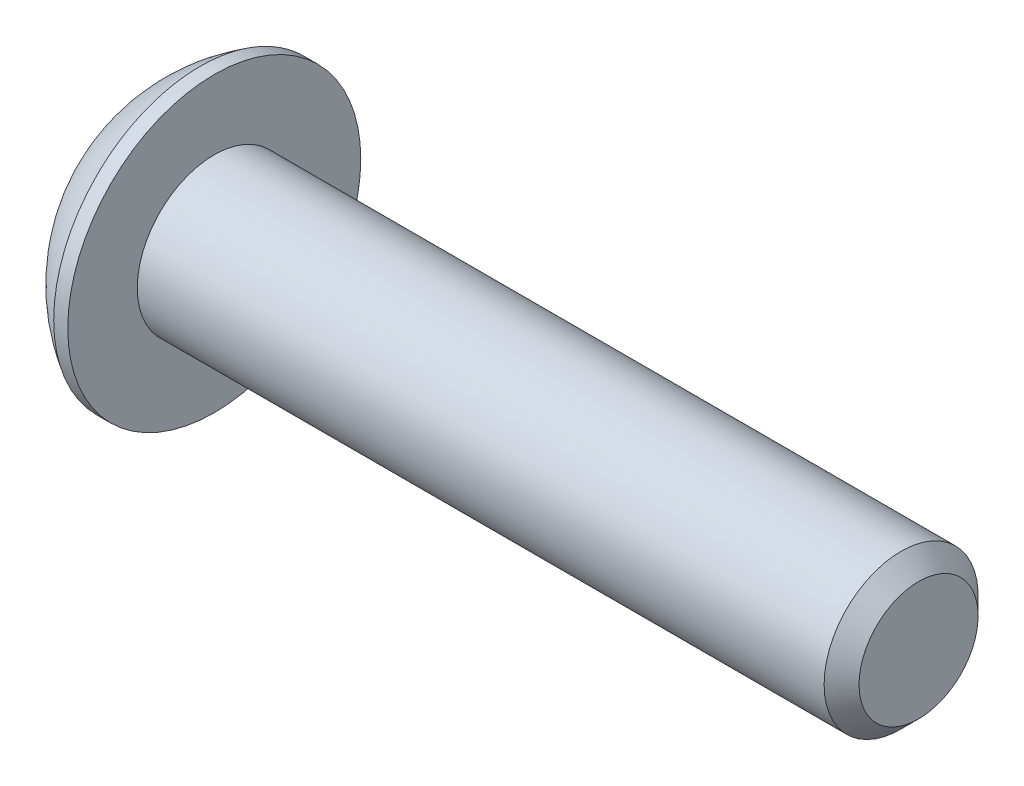
ISO-10303-21;
HEADER;
FILE_DESCRIPTION(('STEP AP214'),'2;1');
FILE_NAME('part.step','',(''),(''),'','','');
FILE_SCHEMA(('AUTOMOTIVE_DESIGN { 1 0 10303 214 1 1 1 1 }'));
ENDSEC;
DATA;
#1=APPLICATION_CONTEXT('core data for automotive mechanical design processes');
#2=APPLICATION_PROTOCOL_DEFINITION('international standard','automotive_design',2000,#1);
#3=PRODUCT_CONTEXT('',#1,'mechanical');
#4=PRODUCT('Part','Part','',(#3));
#5=PRODUCT_RELATED_PRODUCT_CATEGORY('part','',(#4));
#6=PRODUCT_DEFINITION_FORMATION('','',#4);
#7=PRODUCT_DEFINITION_CONTEXT('part definition',#1,'design');
#8=PRODUCT_DEFINITION('design','',#6,#7);
#9=PRODUCT_DEFINITION_SHAPE('','',#8);
#10=(LENGTH_UNIT() NAMED_UNIT(*) SI_UNIT(.MILLI.,.METRE.));
#11=(NAMED_UNIT(*) PLANE_ANGLE_UNIT() SI_UNIT($,.RADIAN.));
#12=(NAMED_UNIT(*) SI_UNIT($,.STERADIAN.) SOLID_ANGLE_UNIT());
#13=UNCERTAINTY_MEASURE_WITH_UNIT(LENGTH_MEASURE(1.E-05),#10,'distance_accuracy_value','');
#14=(GEOMETRIC_REPRESENTATION_CONTEXT(3) GLOBAL_UNCERTAINTY_ASSIGNED_CONTEXT((#13)) GLOBAL_UNIT_ASSIGNED_CONTEXT((#10,
#11,#12)) REPRESENTATION_CONTEXT('',''));
#15=CARTESIAN_POINT('',(0.,0.,0.));
#16=DIRECTION('',(0.,0.,1.));
#17=DIRECTION('',(1.,0.,0.));
#18=AXIS2_PLACEMENT_3D('',#15,#16,#17);
#19=CARTESIAN_POINT('',(1.32080000000034,0.,0.));
#20=DIRECTION('',(-1.,0.,0.));
#21=DIRECTION('',(0.,0.,1.));
#22=AXIS2_PLACEMENT_3D('',#19,#20,#21);
#23=CONICAL_SURFACE('',#22,1.1937999999998,1.04719755119608);
#24=CARTESIAN_POINT('',(2.01004075135902,0.,4.44089209850063E-13));
#25=VERTEX_POINT('',#24);
#26=VERTEX_LOOP('',#25);
#27=FACE_BOUND('',#26,.T.);
#28=CARTESIAN_POINT('',(1.32080000000009,0.,0.));
#29=DIRECTION('',(-1.,0.,0.));
#30=DIRECTION('',(0.,0.,1.));
#31=AXIS2_PLACEMENT_3D('',#28,#29,#30);
#32=CIRCLE('',#31,1.19380000000024);
#33=CARTESIAN_POINT('',(1.32080000000004,-1.03386112703797,0.59690000000006));
#34=VERTEX_POINT('',#33);
#35=CARTESIAN_POINT('',(1.32080000000004,0.,1.19380000000012));
#36=VERTEX_POINT('',#35);
#37=EDGE_CURVE('E19',#34,#36,#32,.T.);
#38=ORIENTED_EDGE('',*,*,#37,.T.);
#39=CARTESIAN_POINT('',(1.32080000000009,0.,0.));
#40=DIRECTION('',(-1.,0.,0.));
#41=DIRECTION('',(0.,0.,1.));
#42=AXIS2_PLACEMENT_3D('',#39,#40,#41);
#43=CIRCLE('',#42,1.19380000000024);
#44=CARTESIAN_POINT('',(1.32080000000004,1.03386112703797,0.596900000000061));
#45=VERTEX_POINT('',#44);
#46=EDGE_CURVE('E148',#36,#45,#43,.T.);
#47=ORIENTED_EDGE('',*,*,#46,.T.);
#48=CARTESIAN_POINT('',(1.32080000000009,0.,0.));
#49=DIRECTION('',(-1.,0.,0.));
#50=DIRECTION('',(0.,0.,1.));
#51=AXIS2_PLACEMENT_3D('',#48,#49,#50);
#52=CIRCLE('',#51,1.19380000000024);
#53=CARTESIAN_POINT('',(1.32080000000004,1.03386112703797,-0.596900000000061));
#54=VERTEX_POINT('',#53);
#55=EDGE_CURVE('E318',#45,#54,#52,.T.);
#56=ORIENTED_EDGE('',*,*,#55,.T.);
#57=CARTESIAN_POINT('',(1.32080000000009,0.,0.));
#58=DIRECTION('',(-1.,0.,0.));
#59=DIRECTION('',(0.,0.,1.));
#60=AXIS2_PLACEMENT_3D('',#57,#58,#59);
#61=CIRCLE('',#60,1.19380000000024);
#62=CARTESIAN_POINT('',(1.32080000000004,1.49457637585666E-12,-1.19380000000012));
#63=VERTEX_POINT('',#62);
#64=EDGE_CURVE('E319',#54,#63,#61,.T.);
#65=ORIENTED_EDGE('',*,*,#64,.T.);
#66=CARTESIAN_POINT('',(1.32080000000009,0.,0.));
#67=DIRECTION('',(-1.,0.,0.));
#68=DIRECTION('',(0.,0.,1.));
#69=AXIS2_PLACEMENT_3D('',#66,#67,#68);
#70=CIRCLE('',#69,1.19380000000024);
#71=CARTESIAN_POINT('',(1.32080000000004,-1.03386112703797,-0.59690000000006));
#72=VERTEX_POINT('',#71);
#73=EDGE_CURVE('E92',#63,#72,#70,.T.);
#74=ORIENTED_EDGE('',*,*,#73,.T.);
#75=CARTESIAN_POINT('',(1.32080000000009,0.,0.));
#76=DIRECTION('',(-1.,0.,0.));
#77=DIRECTION('',(0.,0.,1.));
#78=AXIS2_PLACEMENT_3D('',#75,#76,#77);
#79=CIRCLE('',#78,1.19380000000024);
#80=EDGE_CURVE('E88',#72,#34,#79,.T.);
#81=ORIENTED_EDGE('',*,*,#80,.T.);
#82=EDGE_LOOP('',(#38,#47,#56,#65,#74,#81));
#83=FACE_BOUND('',#82,.T.);
#84=ADVANCED_FACE('F16',(#27,#83),#23,.F.);
#85=CARTESIAN_POINT('',(1.3208,-2.06772225407572,-1.1938));
#86=DIRECTION('',(1.,0.,0.));
#87=DIRECTION('',(0.,0.,-1.));
#88=AXIS2_PLACEMENT_3D('',#85,#86,#87);
#89=PLANE('',#88);
#90=DIRECTION('',(0.,0.5,0.866025403784439));
#91=VECTOR('',#90,1.);
#92=CARTESIAN_POINT('',(1.3208,-1.37848150271715,0.));
#93=LINE('',#92,#91);
#94=CARTESIAN_POINT('',(1.3208,-0.689240751358574,1.1938));
#95=VERTEX_POINT('',#94);
#96=EDGE_CURVE('E100',#95,#34,#93,.F.);
#97=ORIENTED_EDGE('',*,*,#96,.F.);
#98=DIRECTION('',(0.,1.,0.));
#99=VECTOR('',#98,1.);
#100=CARTESIAN_POINT('',(1.3208,-0.689240751358574,1.1938));
#101=LINE('',#100,#99);
#102=EDGE_CURVE('E102',#36,#95,#101,.F.);
#103=ORIENTED_EDGE('',*,*,#102,.F.);
#104=ORIENTED_EDGE('',*,*,#37,.F.);
#105=EDGE_LOOP('',(#97,#103,#104));
#106=FACE_BOUND('',#105,.T.);
#107=ADVANCED_FACE('F98',(#106),#89,.F.);
#108=CARTESIAN_POINT('',(1.3208,-2.06772225407572,-1.1938));
#109=DIRECTION('',(1.,0.,0.));
#110=DIRECTION('',(0.,0.,-1.));
#111=AXIS2_PLACEMENT_3D('',#108,#109,#110);
#112=PLANE('',#111);
#113=DIRECTION('',(0.,-0.5,0.866025403784439));
#114=VECTOR('',#113,1.);
#115=CARTESIAN_POINT('',(1.3208,-0.689240751358574,-1.1938));
#116=LINE('',#115,#114);
#117=CARTESIAN_POINT('',(1.3208,-1.37848150271715,0.));
#118=VERTEX_POINT('',#117);
#119=EDGE_CURVE('E108',#118,#72,#116,.F.);
#120=ORIENTED_EDGE('',*,*,#119,.F.);
#121=DIRECTION('',(0.,0.5,0.866025403784439));
#122=VECTOR('',#121,1.);
#123=CARTESIAN_POINT('',(1.3208,-1.37848150271715,0.));
#124=LINE('',#123,#122);
#125=EDGE_CURVE('E105',#34,#118,#124,.F.);
#126=ORIENTED_EDGE('',*,*,#125,.F.);
#127=ORIENTED_EDGE('',*,*,#80,.F.);
#128=EDGE_LOOP('',(#120,#126,#127));
#129=FACE_BOUND('',#128,.T.);
#130=ADVANCED_FACE('F106',(#129),#112,.F.);
#131=CARTESIAN_POINT('',(1.3208,-2.06772225407572,-1.1938));
#132=DIRECTION('',(1.,0.,0.));
#133=DIRECTION('',(0.,0.,-1.));
#134=AXIS2_PLACEMENT_3D('',#131,#132,#133);
#135=PLANE('',#134);
#136=DIRECTION('',(0.,1.,0.));
#137=VECTOR('',#136,1.);
#138=CARTESIAN_POINT('',(1.3208,0.689240751358577,-1.1938));
#139=LINE('',#138,#137);
#140=CARTESIAN_POINT('',(1.3208,-0.689240751358574,-1.1938));
#141=VERTEX_POINT('',#140);
#142=EDGE_CURVE('E288',#141,#63,#139,.T.);
#143=ORIENTED_EDGE('',*,*,#142,.F.);
#144=DIRECTION('',(0.,-0.5,0.866025403784439));
#145=VECTOR('',#144,1.);
#146=CARTESIAN_POINT('',(1.3208,-0.689240751358574,-1.1938));
#147=LINE('',#146,#145);
#148=EDGE_CURVE('E300',#72,#141,#147,.F.);
#149=ORIENTED_EDGE('',*,*,#148,.F.);
#150=ORIENTED_EDGE('',*,*,#73,.F.);
#151=EDGE_LOOP('',(#143,#149,#150));
#152=FACE_BOUND('',#151,.T.);
#153=ADVANCED_FACE('F191',(#152),#135,.F.);
#154=CARTESIAN_POINT('',(1.3208,-2.06772225407572,-1.1938));
#155=DIRECTION('',(1.,0.,0.));
#156=DIRECTION('',(0.,0.,-1.));
#157=AXIS2_PLACEMENT_3D('',#154,#155,#156);
#158=PLANE('',#157);
#159=DIRECTION('',(0.,-0.5,-0.866025403784439));
#160=VECTOR('',#159,1.);
#161=CARTESIAN_POINT('',(1.3208,1.37848150271715,0.));
#162=LINE('',#161,#160);
#163=CARTESIAN_POINT('',(1.3208,0.689240751358577,-1.1938));
#164=VERTEX_POINT('',#163);
#165=EDGE_CURVE('E274',#164,#54,#162,.F.);
#166=ORIENTED_EDGE('',*,*,#165,.F.);
#167=DIRECTION('',(0.,1.,0.));
#168=VECTOR('',#167,1.);
#169=CARTESIAN_POINT('',(1.3208,0.689240751358577,-1.1938));
#170=LINE('',#169,#168);
#171=EDGE_CURVE('E285',#63,#164,#170,.T.);
#172=ORIENTED_EDGE('',*,*,#171,.F.);
#173=ORIENTED_EDGE('',*,*,#64,.F.);
#174=EDGE_LOOP('',(#166,#172,#173));
#175=FACE_BOUND('',#174,.T.);
#176=ADVANCED_FACE('F187',(#175),#158,.F.);
#177=CARTESIAN_POINT('',(1.3208,-2.06772225407572,-1.1938));
#178=DIRECTION('',(1.,0.,0.));
#179=DIRECTION('',(0.,0.,-1.));
#180=AXIS2_PLACEMENT_3D('',#177,#178,#179);
#181=PLANE('',#180);
#182=DIRECTION('',(0.,0.5,-0.866025403784439));
#183=VECTOR('',#182,1.);
#184=CARTESIAN_POINT('',(1.3208,0.689240751358576,1.1938));
#185=LINE('',#184,#183);
#186=CARTESIAN_POINT('',(1.3208,1.37848150271715,0.));
#187=VERTEX_POINT('',#186);
#188=EDGE_CURVE('E253',#187,#45,#185,.F.);
#189=ORIENTED_EDGE('',*,*,#188,.F.);
#190=DIRECTION('',(0.,-0.5,-0.866025403784439));
#191=VECTOR('',#190,1.);
#192=CARTESIAN_POINT('',(1.3208,1.37848150271715,0.));
#193=LINE('',#192,#191);
#194=EDGE_CURVE('E272',#54,#187,#193,.F.);
#195=ORIENTED_EDGE('',*,*,#194,.F.);
#196=ORIENTED_EDGE('',*,*,#55,.F.);
#197=EDGE_LOOP('',(#189,#195,#196));
#198=FACE_BOUND('',#197,.T.);
#199=ADVANCED_FACE('F183',(#198),#181,.F.);
#200=CARTESIAN_POINT('',(1.3208,-2.06772225407572,-1.1938));
#201=DIRECTION('',(1.,0.,0.));
#202=DIRECTION('',(0.,0.,-1.));
#203=AXIS2_PLACEMENT_3D('',#200,#201,#202);
#204=PLANE('',#203);
#205=DIRECTION('',(0.,1.,0.));
#206=VECTOR('',#205,1.);
#207=CARTESIAN_POINT('',(1.3208,-0.689240751358574,1.1938));
#208=LINE('',#207,#206);
#209=CARTESIAN_POINT('',(1.3208,0.689240751358576,1.1938));
#210=VERTEX_POINT('',#209);
#211=EDGE_CURVE('E117',#210,#36,#208,.F.);
#212=ORIENTED_EDGE('',*,*,#211,.F.);
#213=DIRECTION('',(0.,0.5,-0.866025403784439));
#214=VECTOR('',#213,1.);
#215=CARTESIAN_POINT('',(1.3208,0.689240751358576,1.1938));
#216=LINE('',#215,#214);
#217=EDGE_CURVE('E256',#45,#210,#216,.F.);
#218=ORIENTED_EDGE('',*,*,#217,.F.);
#219=ORIENTED_EDGE('',*,*,#46,.F.);
#220=EDGE_LOOP('',(#212,#218,#219));
#221=FACE_BOUND('',#220,.T.);
#222=ADVANCED_FACE('F179',(#221),#204,.F.);
#223=CARTESIAN_POINT('',(1.3208,-0.689240751358574,1.1938));
#224=DIRECTION('',(0.,0.,-1.));
#225=DIRECTION('',(0.,1.,0.));
#226=AXIS2_PLACEMENT_3D('',#223,#224,#225);
#227=PLANE('',#226);
#228=DIRECTION('',(0.,1.,0.));
#229=VECTOR('',#228,1.);
#230=CARTESIAN_POINT('',(0.,0.,1.1938));
#231=LINE('',#230,#229);
#232=CARTESIAN_POINT('',(0.,0.689240751358577,1.1938));
#233=VERTEX_POINT('',#232);
#234=CARTESIAN_POINT('',(0.,-0.689240751358574,1.1938));
#235=VERTEX_POINT('',#234);
#236=EDGE_CURVE('E250',#233,#235,#231,.F.);
#237=ORIENTED_EDGE('',*,*,#236,.F.);
#238=DIRECTION('',(1.,0.,0.));
#239=VECTOR('',#238,1.);
#240=CARTESIAN_POINT('',(1.3208,0.689240751358576,1.1938));
#241=LINE('',#240,#239);
#242=EDGE_CURVE('E262',#210,#233,#241,.F.);
#243=ORIENTED_EDGE('',*,*,#242,.F.);
#244=ORIENTED_EDGE('',*,*,#211,.T.);
#245=ORIENTED_EDGE('',*,*,#102,.T.);
#246=DIRECTION('',(1.,0.,0.));
#247=VECTOR('',#246,1.);
#248=CARTESIAN_POINT('',(1.3208,-0.689240751358574,1.1938));
#249=LINE('',#248,#247);
#250=EDGE_CURVE('E111',#235,#95,#249,.T.);
#251=ORIENTED_EDGE('',*,*,#250,.F.);
#252=EDGE_LOOP('',(#237,#243,#244,#245,#251));
#253=FACE_BOUND('',#252,.T.);
#254=ADVANCED_FACE('F176',(#253),#227,.T.);
#255=CARTESIAN_POINT('',(1.3208,-1.37848150271715,0.));
#256=DIRECTION('',(0.,0.866025403784439,-0.5));
#257=DIRECTION('',(0.,0.5,0.866025403784439));
#258=AXIS2_PLACEMENT_3D('',#255,#256,#257);
#259=PLANE('',#258);
#260=DIRECTION('',(0.,-0.5,-0.866025403784439));
#261=VECTOR('',#260,1.);
#262=CARTESIAN_POINT('',(0.,-0.689240751358574,1.1938));
#263=LINE('',#262,#261);
#264=CARTESIAN_POINT('',(0.,-1.37848150271715,0.));
#265=VERTEX_POINT('',#264);
#266=EDGE_CURVE('E247',#235,#265,#263,.T.);
#267=ORIENTED_EDGE('',*,*,#266,.F.);
#268=ORIENTED_EDGE('',*,*,#250,.T.);
#269=ORIENTED_EDGE('',*,*,#96,.T.);
#270=ORIENTED_EDGE('',*,*,#125,.T.);
#271=DIRECTION('',(1.,0.,0.));
#272=VECTOR('',#271,1.);
#273=CARTESIAN_POINT('',(1.3208,-1.37848150271715,0.));
#274=LINE('',#273,#272);
#275=EDGE_CURVE('E297',#265,#118,#274,.T.);
#276=ORIENTED_EDGE('',*,*,#275,.F.);
#277=EDGE_LOOP('',(#267,#268,#269,#270,#276));
#278=FACE_BOUND('',#277,.T.);
#279=ADVANCED_FACE('F115',(#278),#259,.T.);
#280=CARTESIAN_POINT('',(1.3208,-0.689240751358574,-1.1938));
#281=DIRECTION('',(0.,0.866025403784439,0.5));
#282=DIRECTION('',(0.,-0.5,0.866025403784439));
#283=AXIS2_PLACEMENT_3D('',#280,#281,#282);
#284=PLANE('',#283);
#285=DIRECTION('',(0.,0.5,-0.866025403784439));
#286=VECTOR('',#285,1.);
#287=CARTESIAN_POINT('',(0.,-1.37848150271715,0.));
#288=LINE('',#287,#286);
#289=CARTESIAN_POINT('',(0.,-0.689240751358574,-1.1938));
#290=VERTEX_POINT('',#289);
#291=EDGE_CURVE('E244',#265,#290,#288,.T.);
#292=ORIENTED_EDGE('',*,*,#291,.F.);
#293=ORIENTED_EDGE('',*,*,#275,.T.);
#294=ORIENTED_EDGE('',*,*,#119,.T.);
#295=ORIENTED_EDGE('',*,*,#148,.T.);
#296=DIRECTION('',(1.,0.,0.));
#297=VECTOR('',#296,1.);
#298=CARTESIAN_POINT('',(1.3208,-0.689240751358574,-1.1938));
#299=LINE('',#298,#297);
#300=EDGE_CURVE('E282',#290,#141,#299,.T.);
#301=ORIENTED_EDGE('',*,*,#300,.F.);
#302=EDGE_LOOP('',(#292,#293,#294,#295,#301));
#303=FACE_BOUND('',#302,.T.);
#304=ADVANCED_FACE('F169',(#303),#284,.T.);
#305=CARTESIAN_POINT('',(1.3208,0.689240751358577,-1.1938));
#306=DIRECTION('',(0.,0.,1.));
#307=DIRECTION('',(1.,0.,0.));
#308=AXIS2_PLACEMENT_3D('',#305,#306,#307);
#309=PLANE('',#308);
#310=DIRECTION('',(0.,1.,0.));
#311=VECTOR('',#310,1.);
#312=CARTESIAN_POINT('',(0.,0.,-1.1938));
#313=LINE('',#312,#311);
#314=CARTESIAN_POINT('',(0.,0.689240751358577,-1.1938));
#315=VERTEX_POINT('',#314);
#316=EDGE_CURVE('E241',#290,#315,#313,.T.);
#317=ORIENTED_EDGE('',*,*,#316,.F.);
#318=ORIENTED_EDGE('',*,*,#300,.T.);
#319=ORIENTED_EDGE('',*,*,#142,.T.);
#320=ORIENTED_EDGE('',*,*,#171,.T.);
#321=DIRECTION('',(1.,0.,0.));
#322=VECTOR('',#321,1.);
#323=CARTESIAN_POINT('',(1.3208,0.689240751358577,-1.1938));
#324=LINE('',#323,#322);
#325=EDGE_CURVE('E257',#315,#164,#324,.T.);
#326=ORIENTED_EDGE('',*,*,#325,.F.);
#327=EDGE_LOOP('',(#317,#318,#319,#320,#326));
#328=FACE_BOUND('',#327,.T.);
#329=ADVANCED_FACE('F166',(#328),#309,.T.);
#330=CARTESIAN_POINT('',(1.3208,1.37848150271715,0.));
#331=DIRECTION('',(0.,-0.866025403784439,0.5));
#332=DIRECTION('',(0.,-0.5,-0.866025403784439));
#333=AXIS2_PLACEMENT_3D('',#330,#331,#332);
#334=PLANE('',#333);
#335=DIRECTION('',(0.,0.5,0.866025403784439));
#336=VECTOR('',#335,1.);
#337=CARTESIAN_POINT('',(0.,0.689240751358577,-1.1938));
#338=LINE('',#337,#336);
#339=CARTESIAN_POINT('',(0.,1.37848150271715,0.));
#340=VERTEX_POINT('',#339);
#341=EDGE_CURVE('E238',#315,#340,#338,.T.);
#342=ORIENTED_EDGE('',*,*,#341,.F.);
#343=ORIENTED_EDGE('',*,*,#325,.T.);
#344=ORIENTED_EDGE('',*,*,#165,.T.);
#345=ORIENTED_EDGE('',*,*,#194,.T.);
#346=DIRECTION('',(1.,0.,0.));
#347=VECTOR('',#346,1.);
#348=CARTESIAN_POINT('',(1.3208,1.37848150271715,0.));
#349=LINE('',#348,#347);
#350=EDGE_CURVE('E34',#340,#187,#349,.T.);
#351=ORIENTED_EDGE('',*,*,#350,.F.);
#352=EDGE_LOOP('',(#342,#343,#344,#345,#351));
#353=FACE_BOUND('',#352,.T.);
#354=ADVANCED_FACE('F162',(#353),#334,.T.);
#355=CARTESIAN_POINT('',(1.3208,0.689240751358576,1.1938));
#356=DIRECTION('',(0.,-0.866025403784439,-0.5));
#357=DIRECTION('',(0.,0.5,-0.866025403784439));
#358=AXIS2_PLACEMENT_3D('',#355,#356,#357);
#359=PLANE('',#358);
#360=DIRECTION('',(0.,-0.5,0.866025403784439));
#361=VECTOR('',#360,1.);
#362=CARTESIAN_POINT('',(0.,1.37848150271715,0.));
#363=LINE('',#362,#361);
#364=EDGE_CURVE('E147',#340,#233,#363,.T.);
#365=ORIENTED_EDGE('',*,*,#364,.F.);
#366=ORIENTED_EDGE('',*,*,#350,.T.);
#367=ORIENTED_EDGE('',*,*,#188,.T.);
#368=ORIENTED_EDGE('',*,*,#217,.T.);
#369=ORIENTED_EDGE('',*,*,#242,.T.);
#370=EDGE_LOOP('',(#365,#366,#367,#368,#369));
#371=FACE_BOUND('',#370,.T.);
#372=ADVANCED_FACE('F158',(#371),#359,.T.);
#373=CARTESIAN_POINT('',(0.,0.,0.));
#374=DIRECTION('',(-1.,0.,0.));
#375=DIRECTION('',(0.,0.,1.));
#376=AXIS2_PLACEMENT_3D('',#373,#374,#375);
#377=PLANE('',#376);
#378=ORIENTED_EDGE('',*,*,#341,.T.);
#379=ORIENTED_EDGE('',*,*,#364,.T.);
#380=ORIENTED_EDGE('',*,*,#236,.T.);
#381=ORIENTED_EDGE('',*,*,#266,.T.);
#382=ORIENTED_EDGE('',*,*,#291,.T.);
#383=ORIENTED_EDGE('',*,*,#316,.T.);
#384=EDGE_LOOP('',(#378,#379,#380,#381,#382,#383));
#385=FACE_BOUND('',#384,.T.);
#386=CARTESIAN_POINT('',(0.,1.9812,0.));
#387=CARTESIAN_POINT('',(0.,1.9811996664299,0.0556258831179428));
#388=CARTESIAN_POINT('',(0.,1.97885520380442,0.111261989398606));
#389=CARTESIAN_POINT('',(0.,1.96949260169541,0.222149719830458));
#390=CARTESIAN_POINT('',(0.,1.96247308239605,0.277401225602895));
#391=CARTESIAN_POINT('',(0.,1.94379192841038,0.387209508139747));
#392=CARTESIAN_POINT('',(-1.85325793235264E-13,1.93212292489526,0.441765039546365));
#393=CARTESIAN_POINT('',(1.86344214223505E-13,1.90422331175315,0.549729449347493));
#394=CARTESIAN_POINT('',(6.94543371897454E-13,1.88798900035338,0.603137359208869));
#395=CARTESIAN_POINT('',(1.15501975216981E-12,1.83266214476501,0.760839131321828));
#396=CARTESIAN_POINT('',(0.,1.78690023648845,0.862876433575429));
#397=CARTESIAN_POINT('',(0.,1.67887358150667,1.05780719540872));
#398=CARTESIAN_POINT('',(9.54193214892627E-13,1.6166082074585,1.15070030720801));
#399=CARTESIAN_POINT('',(5.94805591894675E-13,1.51224157140982,1.28116890915697));
#400=CARTESIAN_POINT('',(1.63221293851378E-13,1.4755970394354,1.32320451127026));
#401=CARTESIAN_POINT('',(-1.62196980336157E-13,1.39893832619713,1.40400288695709));
#402=CARTESIAN_POINT('',(0.,1.35892742784698,1.44276877695455));
#403=CARTESIAN_POINT('',(1.14362537325405E-13,1.23416504602197,1.55382272417904));
#404=CARTESIAN_POINT('',(0.,1.14466125559859,1.62089527952111));
#405=CARTESIAN_POINT('',(0.,0.955712144178167,1.7390221808118));
#406=CARTESIAN_POINT('',(0.,0.856267198233564,1.79007713076007));
#407=CARTESIAN_POINT('',(0.,0.650206345910843,1.87477637530954));
#408=CARTESIAN_POINT('',(0.,0.543590516134855,1.90842085586267));
#409=CARTESIAN_POINT('',(0.,0.326226155292018,1.95733039300656));
#410=CARTESIAN_POINT('',(0.,0.21547760215793,1.97259535144288));
#411=CARTESIAN_POINT('',(0.,-0.00701040587544639,1.98431697865418));
#412=CARTESIAN_POINT('',(0.,-0.118749860774734,1.98077364742917));
#413=CARTESIAN_POINT('',(0.,-0.340050178355485,1.95497485623825));
#414=CARTESIAN_POINT('',(0.,-0.449611052668255,1.93271949620218));
#415=CARTESIAN_POINT('',(0.,-0.663431110729174,1.87014138774523));
#416=CARTESIAN_POINT('',(0.,-0.76769023783852,1.82981844635272));
#417=CARTESIAN_POINT('',(0.,-0.968005760719347,1.73219968377096));
#418=CARTESIAN_POINT('',(0.,-1.0640618469811,1.6749032225164));
#419=CARTESIAN_POINT('',(0.,-1.19980276751283,1.57757371205873));
#420=CARTESIAN_POINT('',(0.,-1.24366557129213,1.54322665019466));
#421=CARTESIAN_POINT('',(0.,-1.32838995706696,1.47093063174264));
#422=CARTESIAN_POINT('',(0.,-1.36924860178706,1.43297823102439));
#423=CARTESIAN_POINT('',(0.,-1.48674671849223,1.31419842051173));
#424=CARTESIAN_POINT('',(0.,-1.55842832343237,1.22836221289311));
#425=CARTESIAN_POINT('',(0.,-1.6863396856475,1.04586168272493));
#426=CARTESIAN_POINT('',(0.,-1.7425700302488,0.949197771949774));
#427=CARTESIAN_POINT('',(0.,-1.8141614250401,0.798182600298684));
#428=CARTESIAN_POINT('',(0.,-1.83591780585875,0.746776203847791));
#429=CARTESIAN_POINT('',(0.,-1.87500754181092,0.642341081688636));
#430=CARTESIAN_POINT('',(0.,-1.89234447645404,0.589313708122847));
#431=CARTESIAN_POINT('',(0.,-1.92246053433554,0.482076273028395));
#432=CARTESIAN_POINT('',(0.,-1.93524685475118,0.42786822425751));
#433=CARTESIAN_POINT('',(0.,-1.95620937250494,0.318578151844611));
#434=CARTESIAN_POINT('',(0.,-1.96438692958147,0.263496390912872));
#435=CARTESIAN_POINT('',(0.,-1.97388528284653,0.173607715038558));
#436=CARTESIAN_POINT('',(0.,-1.97662743364426,0.138944718024998));
#437=CARTESIAN_POINT('',(0.,-1.98028489645283,0.0695224782567002));
#438=CARTESIAN_POINT('',(0.,-1.98120020846367,0.0347632355019631));
#439=CARTESIAN_POINT('',(0.,-1.9811996664299,-0.0556258831179437));
#440=CARTESIAN_POINT('',(0.,-1.97885520380442,-0.111261989398607));
#441=CARTESIAN_POINT('',(0.,-1.96949260169541,-0.222149719830459));
#442=CARTESIAN_POINT('',(0.,-1.96247308239605,-0.277401225602897));
#443=CARTESIAN_POINT('',(0.,-1.94379192841039,-0.387209508139749));
#444=CARTESIAN_POINT('',(-1.85269749640691E-13,-1.93212292489526,-0.441765039546367));
#445=CARTESIAN_POINT('',(1.86288125054388E-13,-1.90422331175315,-0.549729449347495));
#446=CARTESIAN_POINT('',(6.94525090263764E-13,-1.88798900035338,-0.603137359208872));
#447=CARTESIAN_POINT('',(1.15505622829081E-12,-1.83266214476501,-0.760839131321831));
#448=CARTESIAN_POINT('',(0.,-1.78690023648845,-0.862876433575431));
#449=CARTESIAN_POINT('',(0.,-1.67887358150667,-1.05780719540872));
#450=CARTESIAN_POINT('',(9.54248812869379E-13,-1.6166082074585,-1.15070030720801));
#451=CARTESIAN_POINT('',(5.94777756479239E-13,-1.51224157140982,-1.28116890915698));
#452=CARTESIAN_POINT('',(1.63138949183833E-13,-1.47559703943539,-1.32320451127027));
#453=CARTESIAN_POINT('',(-1.62114715061273E-13,-1.39893832619713,-1.40400288695709));
#454=CARTESIAN_POINT('',(0.,-1.35892742784699,-1.44276877695455));
#455=CARTESIAN_POINT('',(1.13760489124207E-13,-1.23416504602197,-1.55382272417904));
#456=CARTESIAN_POINT('',(0.,-1.14466125559859,-1.62089527952111));
#457=CARTESIAN_POINT('',(0.,-0.95571214417816,-1.73902218081179));
#458=CARTESIAN_POINT('',(0.,-0.856267198233559,-1.79007713076007));
#459=CARTESIAN_POINT('',(0.,-0.650206345910841,-1.87477637530954));
#460=CARTESIAN_POINT('',(0.,-0.543590516134854,-1.90842085586267));
#461=CARTESIAN_POINT('',(0.,-0.326226155292018,-1.95733039300657));
#462=CARTESIAN_POINT('',(0.,-0.215477602157929,-1.97259535144288));
#463=CARTESIAN_POINT('',(0.,0.0070104058754487,-1.98431697865418));
#464=CARTESIAN_POINT('',(0.,0.118749860774737,-1.98077364742916));
#465=CARTESIAN_POINT('',(0.,0.340050178355489,-1.95497485623824));
#466=CARTESIAN_POINT('',(0.,0.44961105266826,-1.93271949620218));
#467=CARTESIAN_POINT('',(0.,0.663431110729178,-1.87014138774524));
#468=CARTESIAN_POINT('',(0.,0.767690237838524,-1.82981844635272));
#469=CARTESIAN_POINT('',(0.,0.968005760719348,-1.73219968377096));
#470=CARTESIAN_POINT('',(0.,1.0640618469811,-1.67490322251639));
#471=CARTESIAN_POINT('',(0.,1.19980276751283,-1.57757371205873));
#472=CARTESIAN_POINT('',(0.,1.24366557129214,-1.54322665019465));
#473=CARTESIAN_POINT('',(0.,1.32838995706696,-1.47093063174263));
#474=CARTESIAN_POINT('',(0.,1.36924860178706,-1.43297823102439));
#475=CARTESIAN_POINT('',(0.,1.48674671849223,-1.31419842051172));
#476=CARTESIAN_POINT('',(0.,1.55842832343237,-1.22836221289311));
#477=CARTESIAN_POINT('',(0.,1.6863396856475,-1.04586168272492));
#478=CARTESIAN_POINT('',(0.,1.7425700302488,-0.949197771949768));
#479=CARTESIAN_POINT('',(0.,1.8141614250401,-0.798182600298677));
#480=CARTESIAN_POINT('',(0.,1.83591780585875,-0.746776203847785));
#481=CARTESIAN_POINT('',(0.,1.87500754181092,-0.64234108168863));
#482=CARTESIAN_POINT('',(0.,1.89234447645404,-0.589313708122841));
#483=CARTESIAN_POINT('',(0.,1.92246053433555,-0.482076273028389));
#484=CARTESIAN_POINT('',(0.,1.93524685475118,-0.427868224257505));
#485=CARTESIAN_POINT('',(0.,1.95620937250494,-0.318578151844605));
#486=CARTESIAN_POINT('',(0.,1.96438692958147,-0.263496390912866));
#487=CARTESIAN_POINT('',(0.,1.97388528284653,-0.173607715038553));
#488=CARTESIAN_POINT('',(0.,1.97662743364426,-0.138944718024994));
#489=CARTESIAN_POINT('',(0.,1.98028489645283,-0.0695224782566989));
#490=CARTESIAN_POINT('',(0.,1.98120020846367,-0.034763235501963));
#491=CARTESIAN_POINT('',(0.,1.9812,0.));
#492=B_SPLINE_CURVE_WITH_KNOTS('',3,(#386,#387,#388,#389,#390,#391,#392,#393,#394,#395,#396,
#397,#398,#399,#400,#401,#402,#403,#404,#405,#406,#407,#408,#409,#410,#411,#412,#413,#414,#415,
#416,#417,#418,#419,#420,#421,#422,#423,#424,#425,#426,#427,#428,#429,#430,#431,#432,#433,#434,
#435,#436,#437,#438,#439,#440,#441,#442,#443,#444,#445,#446,#447,#448,#449,#450,#451,#452,#453,
#454,#455,#456,#457,#458,#459,#460,#461,#462,#463,#464,#465,#466,#467,#468,#469,#470,#471,#472,
#473,#474,#475,#476,#477,#478,#479,#480,#481,#482,#483,#484,#485,#486,#487,#488,#489,#490,#491),
.UNSPECIFIED.,.T.,.F.,(4,2,2,2,2,2,2,2,2,2,2,2,2,2,2,2,2,2,2,2,2,2,2,2,2,2,2,2,2,2,2,2,2,2,2,2,
2,2,2,2,2,2,2,2,2,2,2,2,2,2,2,2,4),(0.,0.166845646007828,0.333740557374255,0.500901034367693,
0.668197445942386,1.00199278686282,1.33580081809885,1.50292354032982,1.6698851310853,
2.00370118900129,2.33750465770544,2.67130456115909,3.005106247238,3.33890793331696,
3.67270783677065,4.00651130547476,4.34032736339026,4.50728895414554,4.67441167637632,
5.00821970761259,5.34201504853332,5.50931146010827,5.67647193710191,5.84336684846844,
6.0102124944764,6.11448220058334,6.21875190669029,6.38559755269812,6.55249246406454,
6.71965294105798,6.88694935263268,7.22074469355311,7.55455272478915,7.72167544702011,
7.88863703777559,8.22245309569158,8.55625656439573,8.89005646784938,9.2238581539283,
9.55765984000725,9.89145974346094,10.2252632121651,10.5590792700806,10.7260408608358,
10.8931635830666,11.2269716143029,11.5607669552236,11.7280633667986,11.8952238437922,
12.0621187551587,12.2289644011667,12.3332341072736,12.4375038133806),.UNSPECIFIED.);
#493=CARTESIAN_POINT('',(0.,1.9812,0.));
#494=VERTEX_POINT('',#493);
#495=EDGE_CURVE('E139',#494,#494,#492,.T.);
#496=ORIENTED_EDGE('',*,*,#495,.F.);
#497=EDGE_LOOP('',(#496));
#498=FACE_BOUND('',#497,.T.);
#499=ADVANCED_FACE('F154',(#385,#498),#377,.T.);
#500=CARTESIAN_POINT('',(4.13385,0.,0.));
#501=DIRECTION('',(0.,1.,0.));
#502=DIRECTION('',(1.,0.,0.));
#503=AXIS2_PLACEMENT_3D('',#500,#501,#502);
#504=SPHERICAL_SURFACE('',#503,4.58408870578439);
#505=CARTESIAN_POINT('',(1.8288,0.,0.));
#506=DIRECTION('',(-1.,0.,0.));
#507=DIRECTION('',(0.,0.,1.));
#508=AXIS2_PLACEMENT_3D('',#505,#506,#507);
#509=CIRCLE('',#508,3.9624);
#510=CARTESIAN_POINT('',(1.8288,0.,3.9624));
#511=VERTEX_POINT('',#510);
#512=EDGE_CURVE('E136',#511,#511,#509,.F.);
#513=ORIENTED_EDGE('',*,*,#512,.F.);
#514=EDGE_LOOP('',(#513));
#515=FACE_BOUND('',#514,.T.);
#516=ORIENTED_EDGE('',*,*,#495,.T.);
#517=EDGE_LOOP('',(#516));
#518=FACE_BOUND('',#517,.T.);
#519=ADVANCED_FACE('F150',(#515,#518),#504,.T.);
#520=CARTESIAN_POINT('',(21.2598,0.,0.));
#521=DIRECTION('',(-1.,0.,0.));
#522=DIRECTION('',(0.,0.,1.));
#523=AXIS2_PLACEMENT_3D('',#520,#521,#522);
#524=PLANE('',#523);
#525=CARTESIAN_POINT('',(21.2597999999389,0.,0.));
#526=DIRECTION('',(-1.,0.,0.));
#527=DIRECTION('',(0.,0.,1.));
#528=AXIS2_PLACEMENT_3D('',#525,#526,#527);
#529=CIRCLE('',#528,1.61036000002923);
#530=CARTESIAN_POINT('',(21.2597999999389,0.,1.61036000002923));
#531=VERTEX_POINT('',#530);
#532=EDGE_CURVE('E133',#531,#531,#529,.T.);
#533=ORIENTED_EDGE('',*,*,#532,.F.);
#534=EDGE_LOOP('',(#533));
#535=FACE_BOUND('',#534,.T.);
#536=ADVANCED_FACE('F222',(#535),#524,.F.);
#537=CARTESIAN_POINT('',(0.,0.,0.));
#538=DIRECTION('',(-1.,0.,0.));
#539=DIRECTION('',(0.,0.,1.));
#540=AXIS2_PLACEMENT_3D('',#537,#538,#539);
#541=CYLINDRICAL_SURFACE('',#540,3.9624);
#542=ORIENTED_EDGE('',*,*,#512,.T.);
#543=EDGE_LOOP('',(#542));
#544=FACE_BOUND('',#543,.T.);
#545=CARTESIAN_POINT('',(2.2098,0.,0.));
#546=DIRECTION('',(-1.,0.,0.));
#547=DIRECTION('',(0.,0.,1.));
#548=AXIS2_PLACEMENT_3D('',#545,#546,#547);
#549=CIRCLE('',#548,3.9624);
#550=CARTESIAN_POINT('',(2.2098,0.,3.9624));
#551=VERTEX_POINT('',#550);
#552=EDGE_CURVE('E130',#551,#551,#549,.T.);
#553=ORIENTED_EDGE('',*,*,#552,.T.);
#554=EDGE_LOOP('',(#553));
#555=FACE_BOUND('',#554,.T.);
#556=ADVANCED_FACE('F219',(#544,#555),#541,.T.);
#557=CARTESIAN_POINT('',(20.7873600000426,0.,0.));
#558=DIRECTION('',(-1.,0.,0.));
#559=DIRECTION('',(0.,0.,1.));
#560=AXIS2_PLACEMENT_3D('',#557,#558,#559);
#561=CONICAL_SURFACE('',#560,2.08279999992556,0.785398163397448);
#562=ORIENTED_EDGE('',*,*,#532,.T.);
#563=EDGE_LOOP('',(#562));
#564=FACE_BOUND('',#563,.T.);
#565=CARTESIAN_POINT('',(20.78736,0.,0.));
#566=DIRECTION('',(-1.,0.,0.));
#567=DIRECTION('',(0.,0.,1.));
#568=AXIS2_PLACEMENT_3D('',#565,#566,#567);
#569=CIRCLE('',#568,2.0828);
#570=CARTESIAN_POINT('',(20.78736,0.,2.0828));
#571=VERTEX_POINT('',#570);
#572=EDGE_CURVE('E25',#571,#571,#569,.T.);
#573=ORIENTED_EDGE('',*,*,#572,.F.);
#574=EDGE_LOOP('',(#573));
#575=FACE_BOUND('',#574,.T.);
#576=ADVANCED_FACE('F211',(#564,#575),#561,.T.);
#577=CARTESIAN_POINT('',(2.2098,2.0828,0.));
#578=DIRECTION('',(-1.,0.,0.));
#579=DIRECTION('',(0.,0.,1.));
#580=AXIS2_PLACEMENT_3D('',#577,#578,#579);
#581=PLANE('',#580);
#582=CARTESIAN_POINT('',(2.2098,0.,0.));
#583=DIRECTION('',(-1.,0.,0.));
#584=DIRECTION('',(0.,0.,1.));
#585=AXIS2_PLACEMENT_3D('',#582,#583,#584);
#586=CIRCLE('',#585,2.0828);
#587=CARTESIAN_POINT('',(2.2098,0.,2.0828));
#588=VERTEX_POINT('',#587);
#589=EDGE_CURVE('E11',#588,#588,#586,.F.);
#590=ORIENTED_EDGE('',*,*,#589,.F.);
#591=EDGE_LOOP('',(#590));
#592=FACE_BOUND('',#591,.T.);
#593=ORIENTED_EDGE('',*,*,#552,.F.);
#594=EDGE_LOOP('',(#593));
#595=FACE_BOUND('',#594,.T.);
#596=ADVANCED_FACE('F205',(#592,#595),#581,.F.);
#597=CARTESIAN_POINT('',(0.,0.,0.));
#598=DIRECTION('',(-1.,0.,0.));
#599=DIRECTION('',(0.,0.,1.));
#600=AXIS2_PLACEMENT_3D('',#597,#598,#599);
#601=CYLINDRICAL_SURFACE('',#600,2.0828);
#602=ORIENTED_EDGE('',*,*,#572,.T.);
#603=EDGE_LOOP('',(#602));
#604=FACE_BOUND('',#603,.T.);
#605=ORIENTED_EDGE('',*,*,#589,.T.);
#606=EDGE_LOOP('',(#605));
#607=FACE_BOUND('',#606,.T.);
#608=ADVANCED_FACE('F203',(#604,#607),#601,.T.);
#609=CLOSED_SHELL('',(#84,#107,#130,#153,#176,#199,#222,#254,#279,#304,#329,#354,#372,#499,#519,
#536,#556,#576,#596,#608));
#610=MANIFOLD_SOLID_BREP('B1',#609);
#611=ADVANCED_BREP_SHAPE_REPRESENTATION('',(#18,#610),#14);
#612=SHAPE_DEFINITION_REPRESENTATION(#9,#611);
ENDSEC;
END-ISO-10303-21;
